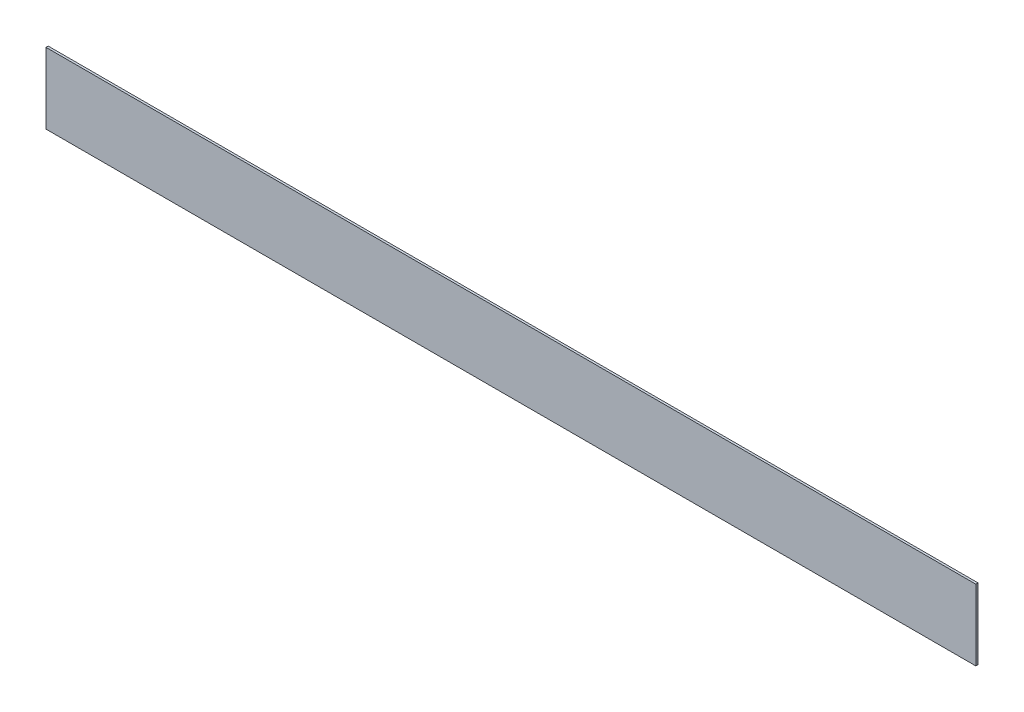
ISO-10303-21;
HEADER;
FILE_DESCRIPTION(('STEP AP214'),'2;1');
FILE_NAME('part.step','',(''),(''),'','','');
FILE_SCHEMA(('AUTOMOTIVE_DESIGN { 1 0 10303 214 1 1 1 1 }'));
ENDSEC;
DATA;
#1=APPLICATION_CONTEXT('core data for automotive mechanical design processes');
#2=APPLICATION_PROTOCOL_DEFINITION('international standard','automotive_design',2000,#1);
#3=PRODUCT_CONTEXT('',#1,'mechanical');
#4=PRODUCT('Part','Part','',(#3));
#5=PRODUCT_RELATED_PRODUCT_CATEGORY('part','',(#4));
#6=PRODUCT_DEFINITION_FORMATION('','',#4);
#7=PRODUCT_DEFINITION_CONTEXT('part definition',#1,'design');
#8=PRODUCT_DEFINITION('design','',#6,#7);
#9=PRODUCT_DEFINITION_SHAPE('','',#8);
#10=(LENGTH_UNIT() NAMED_UNIT(*) SI_UNIT(.MILLI.,.METRE.));
#11=(NAMED_UNIT(*) PLANE_ANGLE_UNIT() SI_UNIT($,.RADIAN.));
#12=(NAMED_UNIT(*) SI_UNIT($,.STERADIAN.) SOLID_ANGLE_UNIT());
#13=UNCERTAINTY_MEASURE_WITH_UNIT(LENGTH_MEASURE(1.E-05),#10,'distance_accuracy_value','');
#14=(GEOMETRIC_REPRESENTATION_CONTEXT(3) GLOBAL_UNCERTAINTY_ASSIGNED_CONTEXT((#13)) GLOBAL_UNIT_ASSIGNED_CONTEXT((#10,
#11,#12)) REPRESENTATION_CONTEXT('',''));
#15=CARTESIAN_POINT('',(0.,0.,0.));
#16=DIRECTION('',(0.,0.,1.));
#17=DIRECTION('',(1.,0.,0.));
#18=AXIS2_PLACEMENT_3D('',#15,#16,#17);
#19=CARTESIAN_POINT('',(21.,-1.6,0.1));
#20=DIRECTION('',(-1.,0.,0.));
#21=DIRECTION('',(0.,0.,1.));
#22=AXIS2_PLACEMENT_3D('',#19,#20,#21);
#23=PLANE('',#22);
#24=DIRECTION('',(0.,1.,0.));
#25=VECTOR('',#24,1.);
#26=CARTESIAN_POINT('',(21.,-1.6,0.));
#27=LINE('',#26,#25);
#28=CARTESIAN_POINT('',(21.,-1.6,0.));
#29=VERTEX_POINT('',#28);
#30=CARTESIAN_POINT('',(21.,1.6,0.));
#31=VERTEX_POINT('',#30);
#32=EDGE_CURVE('E100',#29,#31,#27,.T.);
#33=ORIENTED_EDGE('',*,*,#32,.T.);
#34=DIRECTION('',(0.,0.,-1.));
#35=VECTOR('',#34,1.);
#36=CARTESIAN_POINT('',(21.,1.6,0.1));
#37=LINE('',#36,#35);
#38=CARTESIAN_POINT('',(21.,1.6,0.1));
#39=VERTEX_POINT('',#38);
#40=EDGE_CURVE('E11',#39,#31,#37,.T.);
#41=ORIENTED_EDGE('',*,*,#40,.F.);
#42=DIRECTION('',(0.,1.,0.));
#43=VECTOR('',#42,1.);
#44=CARTESIAN_POINT('',(21.,-1.6,0.1));
#45=LINE('',#44,#43);
#46=CARTESIAN_POINT('',(21.,-1.6,0.1));
#47=VERTEX_POINT('',#46);
#48=EDGE_CURVE('E88',#47,#39,#45,.T.);
#49=ORIENTED_EDGE('',*,*,#48,.F.);
#50=DIRECTION('',(0.,0.,-1.));
#51=VECTOR('',#50,1.);
#52=CARTESIAN_POINT('',(21.,-1.6,0.1));
#53=LINE('',#52,#51);
#54=EDGE_CURVE('E96',#47,#29,#53,.T.);
#55=ORIENTED_EDGE('',*,*,#54,.T.);
#56=EDGE_LOOP('',(#33,#41,#49,#55));
#57=FACE_BOUND('',#56,.T.);
#58=ADVANCED_FACE('F37',(#57),#23,.F.);
#59=CARTESIAN_POINT('',(-21.,1.6,0.1));
#60=DIRECTION('',(0.,-1.,0.));
#61=DIRECTION('',(0.,0.,-1.));
#62=AXIS2_PLACEMENT_3D('',#59,#60,#61);
#63=PLANE('',#62);
#64=DIRECTION('',(-1.,0.,0.));
#65=VECTOR('',#64,1.);
#66=CARTESIAN_POINT('',(-21.,1.6,0.));
#67=LINE('',#66,#65);
#68=CARTESIAN_POINT('',(-21.,1.6,0.));
#69=VERTEX_POINT('',#68);
#70=EDGE_CURVE('E92',#31,#69,#67,.T.);
#71=ORIENTED_EDGE('',*,*,#70,.T.);
#72=DIRECTION('',(0.,0.,-1.));
#73=VECTOR('',#72,1.);
#74=CARTESIAN_POINT('',(-21.,1.6,0.1));
#75=LINE('',#74,#73);
#76=CARTESIAN_POINT('',(-21.,1.6,0.1));
#77=VERTEX_POINT('',#76);
#78=EDGE_CURVE('E45',#77,#69,#75,.T.);
#79=ORIENTED_EDGE('',*,*,#78,.F.);
#80=DIRECTION('',(-1.,0.,0.));
#81=VECTOR('',#80,1.);
#82=CARTESIAN_POINT('',(-21.,1.6,0.1));
#83=LINE('',#82,#81);
#84=EDGE_CURVE('E83',#39,#77,#83,.T.);
#85=ORIENTED_EDGE('',*,*,#84,.F.);
#86=ORIENTED_EDGE('',*,*,#40,.T.);
#87=EDGE_LOOP('',(#71,#79,#85,#86));
#88=FACE_BOUND('',#87,.T.);
#89=ADVANCED_FACE('F91',(#88),#63,.F.);
#90=CARTESIAN_POINT('',(-21.,-1.6,0.1));
#91=DIRECTION('',(1.,0.,0.));
#92=DIRECTION('',(0.,0.,-1.));
#93=AXIS2_PLACEMENT_3D('',#90,#91,#92);
#94=PLANE('',#93);
#95=DIRECTION('',(0.,-1.,0.));
#96=VECTOR('',#95,1.);
#97=CARTESIAN_POINT('',(-21.,-1.6,0.));
#98=LINE('',#97,#96);
#99=CARTESIAN_POINT('',(-21.,-1.6,0.));
#100=VERTEX_POINT('',#99);
#101=EDGE_CURVE('E70',#69,#100,#98,.T.);
#102=ORIENTED_EDGE('',*,*,#101,.T.);
#103=DIRECTION('',(0.,0.,-1.));
#104=VECTOR('',#103,1.);
#105=CARTESIAN_POINT('',(-21.,-1.6,0.1));
#106=LINE('',#105,#104);
#107=CARTESIAN_POINT('',(-21.,-1.6,0.1));
#108=VERTEX_POINT('',#107);
#109=EDGE_CURVE('E93',#108,#100,#106,.T.);
#110=ORIENTED_EDGE('',*,*,#109,.F.);
#111=DIRECTION('',(0.,-1.,0.));
#112=VECTOR('',#111,1.);
#113=CARTESIAN_POINT('',(-21.,-1.6,0.1));
#114=LINE('',#113,#112);
#115=EDGE_CURVE('E86',#77,#108,#114,.T.);
#116=ORIENTED_EDGE('',*,*,#115,.F.);
#117=ORIENTED_EDGE('',*,*,#78,.T.);
#118=EDGE_LOOP('',(#102,#110,#116,#117));
#119=FACE_BOUND('',#118,.T.);
#120=ADVANCED_FACE('F94',(#119),#94,.F.);
#121=CARTESIAN_POINT('',(-21.,-1.6,0.1));
#122=DIRECTION('',(0.,1.,0.));
#123=DIRECTION('',(0.,0.,1.));
#124=AXIS2_PLACEMENT_3D('',#121,#122,#123);
#125=PLANE('',#124);
#126=DIRECTION('',(1.,0.,0.));
#127=VECTOR('',#126,1.);
#128=CARTESIAN_POINT('',(-21.,-1.6,0.));
#129=LINE('',#128,#127);
#130=EDGE_CURVE('E76',#100,#29,#129,.T.);
#131=ORIENTED_EDGE('',*,*,#130,.T.);
#132=ORIENTED_EDGE('',*,*,#54,.F.);
#133=DIRECTION('',(1.,0.,0.));
#134=VECTOR('',#133,1.);
#135=CARTESIAN_POINT('',(-21.,-1.6,0.1));
#136=LINE('',#135,#134);
#137=EDGE_CURVE('E53',#108,#47,#136,.T.);
#138=ORIENTED_EDGE('',*,*,#137,.F.);
#139=ORIENTED_EDGE('',*,*,#109,.T.);
#140=EDGE_LOOP('',(#131,#132,#138,#139));
#141=FACE_BOUND('',#140,.T.);
#142=ADVANCED_FACE('F107',(#141),#125,.F.);
#143=CARTESIAN_POINT('',(0.,0.,0.1));
#144=DIRECTION('',(0.,0.,-1.));
#145=DIRECTION('',(-1.,0.,0.));
#146=AXIS2_PLACEMENT_3D('',#143,#144,#145);
#147=PLANE('',#146);
#148=ORIENTED_EDGE('',*,*,#48,.T.);
#149=ORIENTED_EDGE('',*,*,#84,.T.);
#150=ORIENTED_EDGE('',*,*,#115,.T.);
#151=ORIENTED_EDGE('',*,*,#137,.T.);
#152=EDGE_LOOP('',(#148,#149,#150,#151));
#153=FACE_BOUND('',#152,.T.);
#154=ADVANCED_FACE('F84',(#153),#147,.F.);
#155=CARTESIAN_POINT('',(0.,0.,0.));
#156=DIRECTION('',(0.,0.,-1.));
#157=DIRECTION('',(-1.,0.,0.));
#158=AXIS2_PLACEMENT_3D('',#155,#156,#157);
#159=PLANE('',#158);
#160=ORIENTED_EDGE('',*,*,#32,.F.);
#161=ORIENTED_EDGE('',*,*,#130,.F.);
#162=ORIENTED_EDGE('',*,*,#101,.F.);
#163=ORIENTED_EDGE('',*,*,#70,.F.);
#164=EDGE_LOOP('',(#160,#161,#162,#163));
#165=FACE_BOUND('',#164,.T.);
#166=ADVANCED_FACE('F110',(#165),#159,.T.);
#167=CLOSED_SHELL('',(#58,#89,#120,#142,#154,#166));
#168=MANIFOLD_SOLID_BREP('B2',#167);
#169=ADVANCED_BREP_SHAPE_REPRESENTATION('',(#18,#168),#14);
#170=SHAPE_DEFINITION_REPRESENTATION(#9,#169);
ENDSEC;
END-ISO-10303-21;
